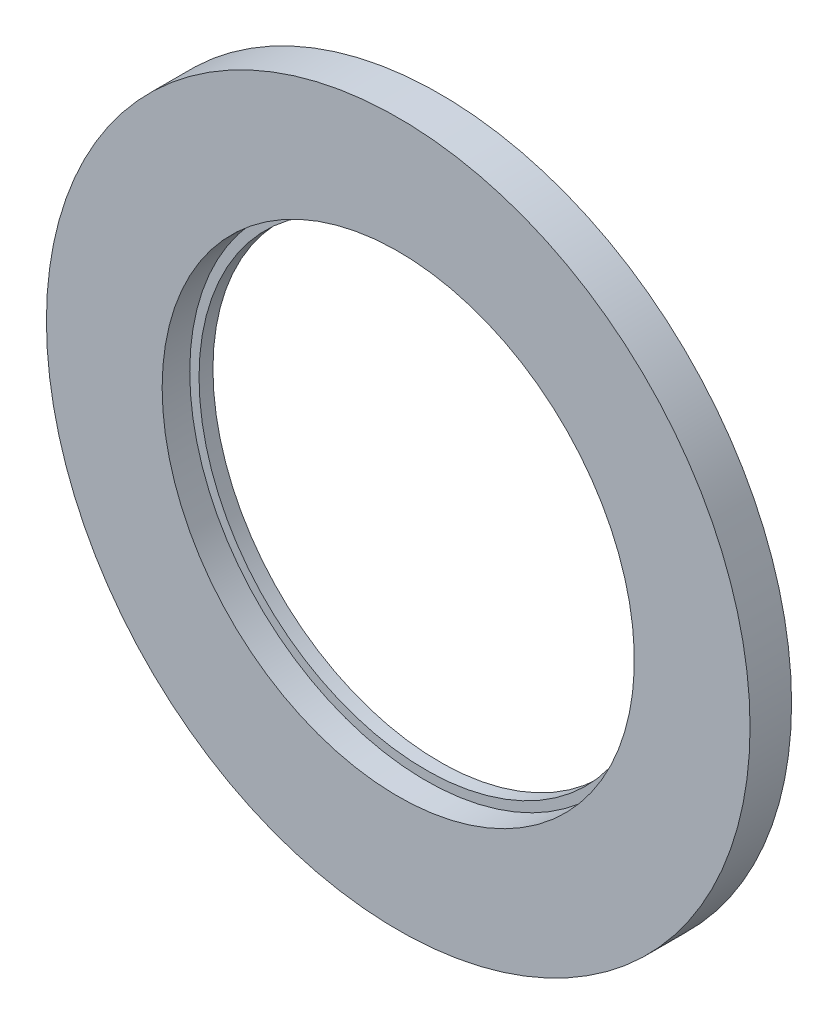
ISO-10303-21;
HEADER;
FILE_DESCRIPTION(('STEP AP214'),'2;1');
FILE_NAME('part.step','',(''),(''),'','','');
FILE_SCHEMA(('AUTOMOTIVE_DESIGN { 1 0 10303 214 1 1 1 1 }'));
ENDSEC;
DATA;
#1=APPLICATION_CONTEXT('core data for automotive mechanical design processes');
#2=APPLICATION_PROTOCOL_DEFINITION('international standard','automotive_design',2000,#1);
#3=PRODUCT_CONTEXT('',#1,'mechanical');
#4=PRODUCT('Part','Part','',(#3));
#5=PRODUCT_RELATED_PRODUCT_CATEGORY('part','',(#4));
#6=PRODUCT_DEFINITION_FORMATION('','',#4);
#7=PRODUCT_DEFINITION_CONTEXT('part definition',#1,'design');
#8=PRODUCT_DEFINITION('design','',#6,#7);
#9=PRODUCT_DEFINITION_SHAPE('','',#8);
#10=(LENGTH_UNIT() NAMED_UNIT(*) SI_UNIT(.MILLI.,.METRE.));
#11=(NAMED_UNIT(*) PLANE_ANGLE_UNIT() SI_UNIT($,.RADIAN.));
#12=(NAMED_UNIT(*) SI_UNIT($,.STERADIAN.) SOLID_ANGLE_UNIT());
#13=UNCERTAINTY_MEASURE_WITH_UNIT(LENGTH_MEASURE(1.E-05),#10,'distance_accuracy_value','');
#14=(GEOMETRIC_REPRESENTATION_CONTEXT(3) GLOBAL_UNCERTAINTY_ASSIGNED_CONTEXT((#13)) GLOBAL_UNIT_ASSIGNED_CONTEXT((#10,
#11,#12)) REPRESENTATION_CONTEXT('',''));
#15=CARTESIAN_POINT('',(0.,0.,0.));
#16=DIRECTION('',(0.,0.,1.));
#17=DIRECTION('',(1.,0.,0.));
#18=AXIS2_PLACEMENT_3D('',#15,#16,#17);
#19=CARTESIAN_POINT('',(0.,0.,10.));
#20=DIRECTION('',(0.,0.,-1.));
#21=DIRECTION('',(-1.,0.,0.));
#22=AXIS2_PLACEMENT_3D('',#19,#20,#21);
#23=CYLINDRICAL_SURFACE('',#22,48.9);
#24=CARTESIAN_POINT('',(0.,0.,0.));
#25=DIRECTION('',(0.,0.,-1.));
#26=DIRECTION('',(-1.,0.,0.));
#27=AXIS2_PLACEMENT_3D('',#24,#25,#26);
#28=CIRCLE('',#27,48.9);
#29=CARTESIAN_POINT('',(-48.9,0.,0.));
#30=VERTEX_POINT('',#29);
#31=EDGE_CURVE('E10',#30,#30,#28,.T.);
#32=ORIENTED_EDGE('',*,*,#31,.T.);
#33=EDGE_LOOP('',(#32));
#34=FACE_BOUND('',#33,.T.);
#35=CARTESIAN_POINT('',(0.,0.,3.));
#36=DIRECTION('',(0.,0.,-1.));
#37=DIRECTION('',(-1.,0.,0.));
#38=AXIS2_PLACEMENT_3D('',#35,#36,#37);
#39=CIRCLE('',#38,48.9);
#40=CARTESIAN_POINT('',(-48.9,0.,3.));
#41=VERTEX_POINT('',#40);
#42=EDGE_CURVE('E59',#41,#41,#39,.T.);
#43=ORIENTED_EDGE('',*,*,#42,.F.);
#44=EDGE_LOOP('',(#43));
#45=FACE_BOUND('',#44,.T.);
#46=ADVANCED_FACE('F37',(#34,#45),#23,.F.);
#47=CARTESIAN_POINT('',(48.9,0.,0.));
#48=DIRECTION('',(0.,0.,-1.));
#49=DIRECTION('',(-1.,0.,0.));
#50=AXIS2_PLACEMENT_3D('',#47,#48,#49);
#51=PLANE('',#50);
#52=CARTESIAN_POINT('',(0.,0.,0.));
#53=DIRECTION('',(0.,0.,-1.));
#54=DIRECTION('',(-1.,0.,0.));
#55=AXIS2_PLACEMENT_3D('',#52,#53,#54);
#56=CIRCLE('',#55,75.85);
#57=CARTESIAN_POINT('',(-75.85,0.,0.));
#58=VERTEX_POINT('',#57);
#59=EDGE_CURVE('E43',#58,#58,#56,.T.);
#60=ORIENTED_EDGE('',*,*,#59,.T.);
#61=EDGE_LOOP('',(#60));
#62=FACE_BOUND('',#61,.T.);
#63=ORIENTED_EDGE('',*,*,#31,.F.);
#64=EDGE_LOOP('',(#63));
#65=FACE_BOUND('',#64,.T.);
#66=ADVANCED_FACE('F67',(#62,#65),#51,.T.);
#67=CARTESIAN_POINT('',(0.,0.,10.));
#68=DIRECTION('',(0.,0.,-1.));
#69=DIRECTION('',(-1.,0.,0.));
#70=AXIS2_PLACEMENT_3D('',#67,#68,#69);
#71=CYLINDRICAL_SURFACE('',#70,75.85);
#72=CARTESIAN_POINT('',(0.,0.,8.951));
#73=DIRECTION('',(0.,0.,-1.));
#74=DIRECTION('',(-1.,0.,0.));
#75=AXIS2_PLACEMENT_3D('',#72,#73,#74);
#76=CIRCLE('',#75,75.85);
#77=CARTESIAN_POINT('',(-75.85,0.,8.951));
#78=VERTEX_POINT('',#77);
#79=EDGE_CURVE('E47',#78,#78,#76,.T.);
#80=ORIENTED_EDGE('',*,*,#79,.T.);
#81=EDGE_LOOP('',(#80));
#82=FACE_BOUND('',#81,.T.);
#83=ORIENTED_EDGE('',*,*,#59,.F.);
#84=EDGE_LOOP('',(#83));
#85=FACE_BOUND('',#84,.T.);
#86=ADVANCED_FACE('F71',(#82,#85),#71,.T.);
#87=CARTESIAN_POINT('',(75.85,0.,8.951));
#88=DIRECTION('',(0.,0.,1.));
#89=DIRECTION('',(1.,0.,0.));
#90=AXIS2_PLACEMENT_3D('',#87,#88,#89);
#91=PLANE('',#90);
#92=CARTESIAN_POINT('',(0.,0.,8.951));
#93=DIRECTION('',(0.,0.,-1.));
#94=DIRECTION('',(-1.,0.,0.));
#95=AXIS2_PLACEMENT_3D('',#92,#93,#94);
#96=CIRCLE('',#95,50.9);
#97=CARTESIAN_POINT('',(-50.9,0.,8.951));
#98=VERTEX_POINT('',#97);
#99=EDGE_CURVE('E51',#98,#98,#96,.T.);
#100=ORIENTED_EDGE('',*,*,#99,.T.);
#101=EDGE_LOOP('',(#100));
#102=FACE_BOUND('',#101,.T.);
#103=ORIENTED_EDGE('',*,*,#79,.F.);
#104=EDGE_LOOP('',(#103));
#105=FACE_BOUND('',#104,.T.);
#106=ADVANCED_FACE('F75',(#102,#105),#91,.T.);
#107=CARTESIAN_POINT('',(0.,0.,10.));
#108=DIRECTION('',(0.,0.,-1.));
#109=DIRECTION('',(-1.,0.,0.));
#110=AXIS2_PLACEMENT_3D('',#107,#108,#109);
#111=CYLINDRICAL_SURFACE('',#110,50.9);
#112=CARTESIAN_POINT('',(0.,0.,3.));
#113=DIRECTION('',(0.,0.,-1.));
#114=DIRECTION('',(-1.,0.,0.));
#115=AXIS2_PLACEMENT_3D('',#112,#113,#114);
#116=CIRCLE('',#115,50.9);
#117=CARTESIAN_POINT('',(-50.9,0.,3.));
#118=VERTEX_POINT('',#117);
#119=EDGE_CURVE('E56',#118,#118,#116,.T.);
#120=ORIENTED_EDGE('',*,*,#119,.T.);
#121=EDGE_LOOP('',(#120));
#122=FACE_BOUND('',#121,.T.);
#123=ORIENTED_EDGE('',*,*,#99,.F.);
#124=EDGE_LOOP('',(#123));
#125=FACE_BOUND('',#124,.T.);
#126=ADVANCED_FACE('F82',(#122,#125),#111,.F.);
#127=CARTESIAN_POINT('',(50.9,0.,3.));
#128=DIRECTION('',(0.,0.,1.));
#129=DIRECTION('',(1.,0.,0.));
#130=AXIS2_PLACEMENT_3D('',#127,#128,#129);
#131=PLANE('',#130);
#132=ORIENTED_EDGE('',*,*,#42,.T.);
#133=EDGE_LOOP('',(#132));
#134=FACE_BOUND('',#133,.T.);
#135=ORIENTED_EDGE('',*,*,#119,.F.);
#136=EDGE_LOOP('',(#135));
#137=FACE_BOUND('',#136,.T.);
#138=ADVANCED_FACE('F63',(#134,#137),#131,.T.);
#139=CLOSED_SHELL('',(#46,#66,#86,#106,#126,#138));
#140=MANIFOLD_SOLID_BREP('B2',#139);
#141=ADVANCED_BREP_SHAPE_REPRESENTATION('',(#18,#140),#14);
#142=SHAPE_DEFINITION_REPRESENTATION(#9,#141);
ENDSEC;
END-ISO-10303-21;
